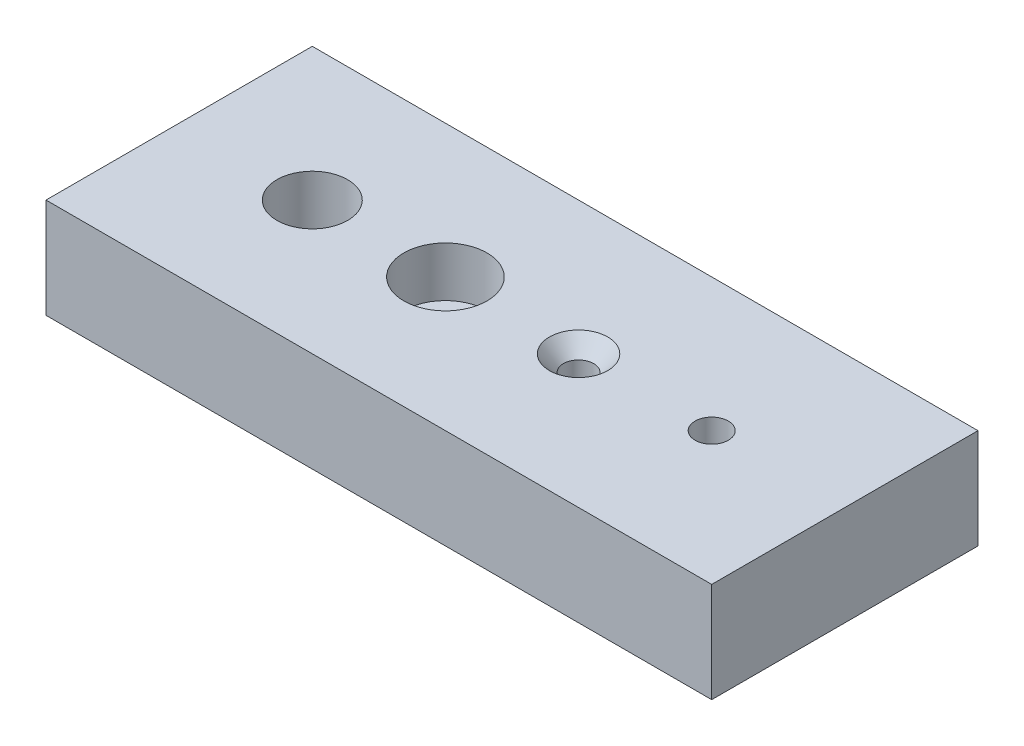
ISO-10303-21;
HEADER;
FILE_DESCRIPTION(('STEP AP214'),'2;1');
FILE_NAME('part.step','',(''),(''),'','','');
FILE_SCHEMA(('AUTOMOTIVE_DESIGN { 1 0 10303 214 1 1 1 1 }'));
ENDSEC;
DATA;
#1=APPLICATION_CONTEXT('core data for automotive mechanical design processes');
#2=APPLICATION_PROTOCOL_DEFINITION('international standard','automotive_design',2000,#1);
#3=PRODUCT_CONTEXT('',#1,'mechanical');
#4=PRODUCT('Part','Part','',(#3));
#5=PRODUCT_RELATED_PRODUCT_CATEGORY('part','',(#4));
#6=PRODUCT_DEFINITION_FORMATION('','',#4);
#7=PRODUCT_DEFINITION_CONTEXT('part definition',#1,'design');
#8=PRODUCT_DEFINITION('design','',#6,#7);
#9=PRODUCT_DEFINITION_SHAPE('','',#8);
#10=(LENGTH_UNIT() NAMED_UNIT(*) SI_UNIT(.MILLI.,.METRE.));
#11=(NAMED_UNIT(*) PLANE_ANGLE_UNIT() SI_UNIT($,.RADIAN.));
#12=(NAMED_UNIT(*) SI_UNIT($,.STERADIAN.) SOLID_ANGLE_UNIT());
#13=UNCERTAINTY_MEASURE_WITH_UNIT(LENGTH_MEASURE(1.E-05),#10,'distance_accuracy_value','');
#14=(GEOMETRIC_REPRESENTATION_CONTEXT(3) GLOBAL_UNCERTAINTY_ASSIGNED_CONTEXT((#13)) GLOBAL_UNIT_ASSIGNED_CONTEXT((#10,
#11,#12)) REPRESENTATION_CONTEXT('',''));
#15=CARTESIAN_POINT('',(0.,0.,0.));
#16=DIRECTION('',(0.,0.,1.));
#17=DIRECTION('',(1.,0.,0.));
#18=AXIS2_PLACEMENT_3D('',#15,#16,#17);
#19=CARTESIAN_POINT('',(0.,0.,50.8));
#20=DIRECTION('',(1.,0.,0.));
#21=DIRECTION('',(0.,0.,-1.));
#22=AXIS2_PLACEMENT_3D('',#19,#20,#21);
#23=PLANE('',#22);
#24=DIRECTION('',(0.,-1.,0.));
#25=VECTOR('',#24,1.);
#26=CARTESIAN_POINT('',(0.,0.,0.));
#27=LINE('',#26,#25);
#28=CARTESIAN_POINT('',(0.,19.05,0.));
#29=VERTEX_POINT('',#28);
#30=CARTESIAN_POINT('',(0.,0.,0.));
#31=VERTEX_POINT('',#30);
#32=EDGE_CURVE('E112',#29,#31,#27,.T.);
#33=ORIENTED_EDGE('',*,*,#32,.T.);
#34=DIRECTION('',(0.,0.,-1.));
#35=VECTOR('',#34,1.);
#36=CARTESIAN_POINT('',(0.,0.,50.8));
#37=LINE('',#36,#35);
#38=CARTESIAN_POINT('',(0.,0.,50.8));
#39=VERTEX_POINT('',#38);
#40=EDGE_CURVE('E13',#39,#31,#37,.T.);
#41=ORIENTED_EDGE('',*,*,#40,.F.);
#42=DIRECTION('',(0.,-1.,0.));
#43=VECTOR('',#42,1.);
#44=CARTESIAN_POINT('',(0.,0.,50.8));
#45=LINE('',#44,#43);
#46=CARTESIAN_POINT('',(0.,19.05,50.8));
#47=VERTEX_POINT('',#46);
#48=EDGE_CURVE('E100',#47,#39,#45,.T.);
#49=ORIENTED_EDGE('',*,*,#48,.F.);
#50=DIRECTION('',(0.,0.,-1.));
#51=VECTOR('',#50,1.);
#52=CARTESIAN_POINT('',(0.,19.05,50.8));
#53=LINE('',#52,#51);
#54=EDGE_CURVE('E108',#47,#29,#53,.T.);
#55=ORIENTED_EDGE('',*,*,#54,.T.);
#56=EDGE_LOOP('',(#33,#41,#49,#55));
#57=FACE_BOUND('',#56,.T.);
#58=ADVANCED_FACE('F49',(#57),#23,.F.);
#59=CARTESIAN_POINT('',(0.,0.,50.8));
#60=DIRECTION('',(0.,1.,0.));
#61=DIRECTION('',(0.,0.,1.));
#62=AXIS2_PLACEMENT_3D('',#59,#60,#61);
#63=PLANE('',#62);
#64=CARTESIAN_POINT('',(101.6,0.,25.4));
#65=DIRECTION('',(0.,1.,0.));
#66=DIRECTION('',(0.,0.,1.));
#67=AXIS2_PLACEMENT_3D('',#64,#65,#66);
#68=CIRCLE('',#67,3.175);
#69=CARTESIAN_POINT('',(101.6,0.,28.575));
#70=VERTEX_POINT('',#69);
#71=EDGE_CURVE('E152',#70,#70,#68,.T.);
#72=ORIENTED_EDGE('',*,*,#71,.T.);
#73=EDGE_LOOP('',(#72));
#74=FACE_BOUND('',#73,.T.);
#75=CARTESIAN_POINT('',(76.2,0.,25.4));
#76=DIRECTION('',(0.,1.,0.));
#77=DIRECTION('',(0.,0.,1.));
#78=AXIS2_PLACEMENT_3D('',#75,#76,#77);
#79=CIRCLE('',#78,2.8956);
#80=CARTESIAN_POINT('',(76.2,0.,28.2956));
#81=VERTEX_POINT('',#80);
#82=EDGE_CURVE('E143',#81,#81,#79,.T.);
#83=ORIENTED_EDGE('',*,*,#82,.T.);
#84=EDGE_LOOP('',(#83));
#85=FACE_BOUND('',#84,.T.);
#86=CARTESIAN_POINT('',(50.8,0.,25.4));
#87=DIRECTION('',(0.,1.,0.));
#88=DIRECTION('',(0.,0.,1.));
#89=AXIS2_PLACEMENT_3D('',#86,#87,#88);
#90=CIRCLE('',#89,4.9022);
#91=CARTESIAN_POINT('',(50.8,0.,30.3022));
#92=VERTEX_POINT('',#91);
#93=EDGE_CURVE('E131',#92,#92,#90,.T.);
#94=ORIENTED_EDGE('',*,*,#93,.T.);
#95=EDGE_LOOP('',(#94));
#96=FACE_BOUND('',#95,.T.);
#97=CARTESIAN_POINT('',(25.4,0.,25.4));
#98=DIRECTION('',(0.,1.,0.));
#99=DIRECTION('',(0.,0.,1.));
#100=AXIS2_PLACEMENT_3D('',#97,#98,#99);
#101=CIRCLE('',#100,6.74623999999999);
#102=CARTESIAN_POINT('',(25.4,0.,32.14624));
#103=VERTEX_POINT('',#102);
#104=EDGE_CURVE('E115',#103,#103,#101,.T.);
#105=ORIENTED_EDGE('',*,*,#104,.T.);
#106=EDGE_LOOP('',(#105));
#107=FACE_BOUND('',#106,.T.);
#108=DIRECTION('',(1.,0.,0.));
#109=VECTOR('',#108,1.);
#110=CARTESIAN_POINT('',(0.,0.,0.));
#111=LINE('',#110,#109);
#112=CARTESIAN_POINT('',(127.,0.,0.));
#113=VERTEX_POINT('',#112);
#114=EDGE_CURVE('E104',#31,#113,#111,.T.);
#115=ORIENTED_EDGE('',*,*,#114,.T.);
#116=DIRECTION('',(0.,0.,-1.));
#117=VECTOR('',#116,1.);
#118=CARTESIAN_POINT('',(127.,0.,50.8));
#119=LINE('',#118,#117);
#120=CARTESIAN_POINT('',(127.,0.,50.8));
#121=VERTEX_POINT('',#120);
#122=EDGE_CURVE('E57',#121,#113,#119,.T.);
#123=ORIENTED_EDGE('',*,*,#122,.F.);
#124=DIRECTION('',(1.,0.,0.));
#125=VECTOR('',#124,1.);
#126=CARTESIAN_POINT('',(0.,0.,50.8));
#127=LINE('',#126,#125);
#128=EDGE_CURVE('E95',#39,#121,#127,.T.);
#129=ORIENTED_EDGE('',*,*,#128,.F.);
#130=ORIENTED_EDGE('',*,*,#40,.T.);
#131=EDGE_LOOP('',(#115,#123,#129,#130));
#132=FACE_BOUND('',#131,.T.);
#133=ADVANCED_FACE('F103',(#74,#85,#96,#107,#132),#63,.F.);
#134=CARTESIAN_POINT('',(127.,0.,50.8));
#135=DIRECTION('',(-1.,0.,0.));
#136=DIRECTION('',(0.,0.,1.));
#137=AXIS2_PLACEMENT_3D('',#134,#135,#136);
#138=PLANE('',#137);
#139=DIRECTION('',(0.,1.,0.));
#140=VECTOR('',#139,1.);
#141=CARTESIAN_POINT('',(127.,0.,0.));
#142=LINE('',#141,#140);
#143=CARTESIAN_POINT('',(127.,19.05,0.));
#144=VERTEX_POINT('',#143);
#145=EDGE_CURVE('E82',#113,#144,#142,.T.);
#146=ORIENTED_EDGE('',*,*,#145,.T.);
#147=DIRECTION('',(0.,0.,-1.));
#148=VECTOR('',#147,1.);
#149=CARTESIAN_POINT('',(127.,19.05,50.8));
#150=LINE('',#149,#148);
#151=CARTESIAN_POINT('',(127.,19.05,50.8));
#152=VERTEX_POINT('',#151);
#153=EDGE_CURVE('E105',#152,#144,#150,.T.);
#154=ORIENTED_EDGE('',*,*,#153,.F.);
#155=DIRECTION('',(0.,1.,0.));
#156=VECTOR('',#155,1.);
#157=CARTESIAN_POINT('',(127.,0.,50.8));
#158=LINE('',#157,#156);
#159=EDGE_CURVE('E98',#121,#152,#158,.T.);
#160=ORIENTED_EDGE('',*,*,#159,.F.);
#161=ORIENTED_EDGE('',*,*,#122,.T.);
#162=EDGE_LOOP('',(#146,#154,#160,#161));
#163=FACE_BOUND('',#162,.T.);
#164=ADVANCED_FACE('F106',(#163),#138,.F.);
#165=CARTESIAN_POINT('',(0.,19.05,50.8));
#166=DIRECTION('',(0.,-1.,0.));
#167=DIRECTION('',(0.,0.,-1.));
#168=AXIS2_PLACEMENT_3D('',#165,#166,#167);
#169=PLANE('',#168);
#170=CARTESIAN_POINT('',(101.6,19.05,25.4));
#171=DIRECTION('',(0.,1.,0.));
#172=DIRECTION('',(0.,0.,1.));
#173=AXIS2_PLACEMENT_3D('',#170,#171,#172);
#174=CIRCLE('',#173,3.175);
#175=CARTESIAN_POINT('',(101.6,19.05,28.575));
#176=VERTEX_POINT('',#175);
#177=EDGE_CURVE('E155',#176,#176,#174,.T.);
#178=ORIENTED_EDGE('',*,*,#177,.F.);
#179=EDGE_LOOP('',(#178));
#180=FACE_BOUND('',#179,.T.);
#181=CARTESIAN_POINT('',(76.2,19.05,25.4));
#182=DIRECTION('',(0.,1.,0.));
#183=DIRECTION('',(0.,0.,1.));
#184=AXIS2_PLACEMENT_3D('',#181,#182,#183);
#185=CIRCLE('',#184,5.5626);
#186=CARTESIAN_POINT('',(76.2,19.05,30.9626));
#187=VERTEX_POINT('',#186);
#188=EDGE_CURVE('E149',#187,#187,#185,.T.);
#189=ORIENTED_EDGE('',*,*,#188,.F.);
#190=EDGE_LOOP('',(#189));
#191=FACE_BOUND('',#190,.T.);
#192=CARTESIAN_POINT('',(50.8,19.05,25.4));
#193=DIRECTION('',(0.,1.,0.));
#194=DIRECTION('',(0.,0.,1.));
#195=AXIS2_PLACEMENT_3D('',#192,#193,#194);
#196=CIRCLE('',#195,7.9375);
#197=CARTESIAN_POINT('',(50.8,19.05,33.3375));
#198=VERTEX_POINT('',#197);
#199=EDGE_CURVE('E140',#198,#198,#196,.T.);
#200=ORIENTED_EDGE('',*,*,#199,.F.);
#201=EDGE_LOOP('',(#200));
#202=FACE_BOUND('',#201,.T.);
#203=CARTESIAN_POINT('',(25.4,19.05,25.4));
#204=DIRECTION('',(0.,1.,0.));
#205=DIRECTION('',(0.,0.,1.));
#206=AXIS2_PLACEMENT_3D('',#203,#204,#205);
#207=CIRCLE('',#206,6.74624);
#208=CARTESIAN_POINT('',(25.4,19.05,32.14624));
#209=VERTEX_POINT('',#208);
#210=EDGE_CURVE('E128',#209,#209,#207,.T.);
#211=ORIENTED_EDGE('',*,*,#210,.F.);
#212=EDGE_LOOP('',(#211));
#213=FACE_BOUND('',#212,.T.);
#214=DIRECTION('',(-1.,0.,0.));
#215=VECTOR('',#214,1.);
#216=CARTESIAN_POINT('',(0.,19.05,0.));
#217=LINE('',#216,#215);
#218=EDGE_CURVE('E88',#144,#29,#217,.T.);
#219=ORIENTED_EDGE('',*,*,#218,.T.);
#220=ORIENTED_EDGE('',*,*,#54,.F.);
#221=DIRECTION('',(-1.,0.,0.));
#222=VECTOR('',#221,1.);
#223=CARTESIAN_POINT('',(0.,19.05,50.8));
#224=LINE('',#223,#222);
#225=EDGE_CURVE('E65',#152,#47,#224,.T.);
#226=ORIENTED_EDGE('',*,*,#225,.F.);
#227=ORIENTED_EDGE('',*,*,#153,.T.);
#228=EDGE_LOOP('',(#219,#220,#226,#227));
#229=FACE_BOUND('',#228,.T.);
#230=ADVANCED_FACE('F120',(#180,#191,#202,#213,#229),#169,.F.);
#231=CARTESIAN_POINT('',(0.,0.,50.8));
#232=DIRECTION('',(0.,0.,-1.));
#233=DIRECTION('',(-1.,0.,0.));
#234=AXIS2_PLACEMENT_3D('',#231,#232,#233);
#235=PLANE('',#234);
#236=ORIENTED_EDGE('',*,*,#48,.T.);
#237=ORIENTED_EDGE('',*,*,#128,.T.);
#238=ORIENTED_EDGE('',*,*,#159,.T.);
#239=ORIENTED_EDGE('',*,*,#225,.T.);
#240=EDGE_LOOP('',(#236,#237,#238,#239));
#241=FACE_BOUND('',#240,.T.);
#242=ADVANCED_FACE('F96',(#241),#235,.F.);
#243=CARTESIAN_POINT('',(0.,0.,0.));
#244=DIRECTION('',(0.,0.,-1.));
#245=DIRECTION('',(-1.,0.,0.));
#246=AXIS2_PLACEMENT_3D('',#243,#244,#245);
#247=PLANE('',#246);
#248=ORIENTED_EDGE('',*,*,#32,.F.);
#249=ORIENTED_EDGE('',*,*,#218,.F.);
#250=ORIENTED_EDGE('',*,*,#145,.F.);
#251=ORIENTED_EDGE('',*,*,#114,.F.);
#252=EDGE_LOOP('',(#248,#249,#250,#251));
#253=FACE_BOUND('',#252,.T.);
#254=ADVANCED_FACE('F123',(#253),#247,.T.);
#255=CARTESIAN_POINT('',(25.4,19.05,25.4));
#256=DIRECTION('',(0.,1.,0.));
#257=DIRECTION('',(0.,0.,1.));
#258=AXIS2_PLACEMENT_3D('',#255,#256,#257);
#259=CYLINDRICAL_SURFACE('',#258,6.74624);
#260=ORIENTED_EDGE('',*,*,#104,.F.);
#261=EDGE_LOOP('',(#260));
#262=FACE_BOUND('',#261,.T.);
#263=ORIENTED_EDGE('',*,*,#210,.T.);
#264=EDGE_LOOP('',(#263));
#265=FACE_BOUND('',#264,.T.);
#266=ADVANCED_FACE('F170',(#262,#265),#259,.F.);
#267=CARTESIAN_POINT('',(50.8,19.05,25.4));
#268=DIRECTION('',(0.,1.,0.));
#269=DIRECTION('',(0.,0.,1.));
#270=AXIS2_PLACEMENT_3D('',#267,#268,#269);
#271=CYLINDRICAL_SURFACE('',#270,4.9022);
#272=ORIENTED_EDGE('',*,*,#93,.F.);
#273=EDGE_LOOP('',(#272));
#274=FACE_BOUND('',#273,.T.);
#275=CARTESIAN_POINT('',(50.8,9.52499999999999,25.4));
#276=DIRECTION('',(0.,1.,0.));
#277=DIRECTION('',(0.,0.,1.));
#278=AXIS2_PLACEMENT_3D('',#275,#276,#277);
#279=CIRCLE('',#278,4.9022);
#280=CARTESIAN_POINT('',(50.8,9.52499999999999,30.3022));
#281=VERTEX_POINT('',#280);
#282=EDGE_CURVE('E134',#281,#281,#279,.T.);
#283=ORIENTED_EDGE('',*,*,#282,.T.);
#284=EDGE_LOOP('',(#283));
#285=FACE_BOUND('',#284,.T.);
#286=ADVANCED_FACE('F172',(#274,#285),#271,.F.);
#287=CARTESIAN_POINT('',(55.7022,9.52499999999999,25.4));
#288=DIRECTION('',(0.,-1.,0.));
#289=DIRECTION('',(0.,0.,-1.));
#290=AXIS2_PLACEMENT_3D('',#287,#288,#289);
#291=PLANE('',#290);
#292=ORIENTED_EDGE('',*,*,#282,.F.);
#293=EDGE_LOOP('',(#292));
#294=FACE_BOUND('',#293,.T.);
#295=CARTESIAN_POINT('',(50.8,9.52499999999999,25.4));
#296=DIRECTION('',(0.,1.,0.));
#297=DIRECTION('',(0.,0.,1.));
#298=AXIS2_PLACEMENT_3D('',#295,#296,#297);
#299=CIRCLE('',#298,7.9375);
#300=CARTESIAN_POINT('',(50.8,9.52499999999999,33.3375));
#301=VERTEX_POINT('',#300);
#302=EDGE_CURVE('E137',#301,#301,#299,.T.);
#303=ORIENTED_EDGE('',*,*,#302,.T.);
#304=EDGE_LOOP('',(#303));
#305=FACE_BOUND('',#304,.T.);
#306=ADVANCED_FACE('F179',(#294,#305),#291,.F.);
#307=CARTESIAN_POINT('',(50.8,19.05,25.4));
#308=DIRECTION('',(0.,1.,0.));
#309=DIRECTION('',(0.,0.,1.));
#310=AXIS2_PLACEMENT_3D('',#307,#308,#309);
#311=CYLINDRICAL_SURFACE('',#310,7.9375);
#312=ORIENTED_EDGE('',*,*,#302,.F.);
#313=EDGE_LOOP('',(#312));
#314=FACE_BOUND('',#313,.T.);
#315=ORIENTED_EDGE('',*,*,#199,.T.);
#316=EDGE_LOOP('',(#315));
#317=FACE_BOUND('',#316,.T.);
#318=ADVANCED_FACE('F217',(#314,#317),#311,.F.);
#319=CARTESIAN_POINT('',(76.2,19.05,25.4));
#320=DIRECTION('',(0.,1.,0.));
#321=DIRECTION('',(0.,0.,1.));
#322=AXIS2_PLACEMENT_3D('',#319,#320,#321);
#323=CYLINDRICAL_SURFACE('',#322,2.8956);
#324=ORIENTED_EDGE('',*,*,#82,.F.);
#325=EDGE_LOOP('',(#324));
#326=FACE_BOUND('',#325,.T.);
#327=CARTESIAN_POINT('',(76.2,15.9819674579416,25.4));
#328=DIRECTION('',(0.,1.,0.));
#329=DIRECTION('',(0.,0.,1.));
#330=AXIS2_PLACEMENT_3D('',#327,#328,#329);
#331=CIRCLE('',#330,2.8956);
#332=CARTESIAN_POINT('',(76.2,15.9819674579416,28.2956));
#333=VERTEX_POINT('',#332);
#334=EDGE_CURVE('E146',#333,#333,#331,.T.);
#335=ORIENTED_EDGE('',*,*,#334,.T.);
#336=EDGE_LOOP('',(#335));
#337=FACE_BOUND('',#336,.T.);
#338=ADVANCED_FACE('F225',(#326,#337),#323,.F.);
#339=CARTESIAN_POINT('',(76.2,19.05,25.4));
#340=DIRECTION('',(0.,1.,0.));
#341=DIRECTION('',(0.,0.,1.));
#342=AXIS2_PLACEMENT_3D('',#339,#340,#341);
#343=CONICAL_SURFACE('',#342,5.5626,0.715584993317675);
#344=ORIENTED_EDGE('',*,*,#334,.F.);
#345=EDGE_LOOP('',(#344));
#346=FACE_BOUND('',#345,.T.);
#347=ORIENTED_EDGE('',*,*,#188,.T.);
#348=EDGE_LOOP('',(#347));
#349=FACE_BOUND('',#348,.T.);
#350=ADVANCED_FACE('F233',(#346,#349),#343,.F.);
#351=CARTESIAN_POINT('',(101.6,19.05,25.4));
#352=DIRECTION('',(0.,1.,0.));
#353=DIRECTION('',(0.,0.,1.));
#354=AXIS2_PLACEMENT_3D('',#351,#352,#353);
#355=CYLINDRICAL_SURFACE('',#354,3.175);
#356=ORIENTED_EDGE('',*,*,#71,.F.);
#357=EDGE_LOOP('',(#356));
#358=FACE_BOUND('',#357,.T.);
#359=ORIENTED_EDGE('',*,*,#177,.T.);
#360=EDGE_LOOP('',(#359));
#361=FACE_BOUND('',#360,.T.);
#362=ADVANCED_FACE('F159',(#358,#361),#355,.F.);
#363=CLOSED_SHELL('',(#58,#133,#164,#230,#242,#254,#266,#286,#306,#318,#338,#350,#362));
#364=MANIFOLD_SOLID_BREP('B2',#363);
#365=ADVANCED_BREP_SHAPE_REPRESENTATION('',(#18,#364),#14);
#366=SHAPE_DEFINITION_REPRESENTATION(#9,#365);
ENDSEC;
END-ISO-10303-21;
